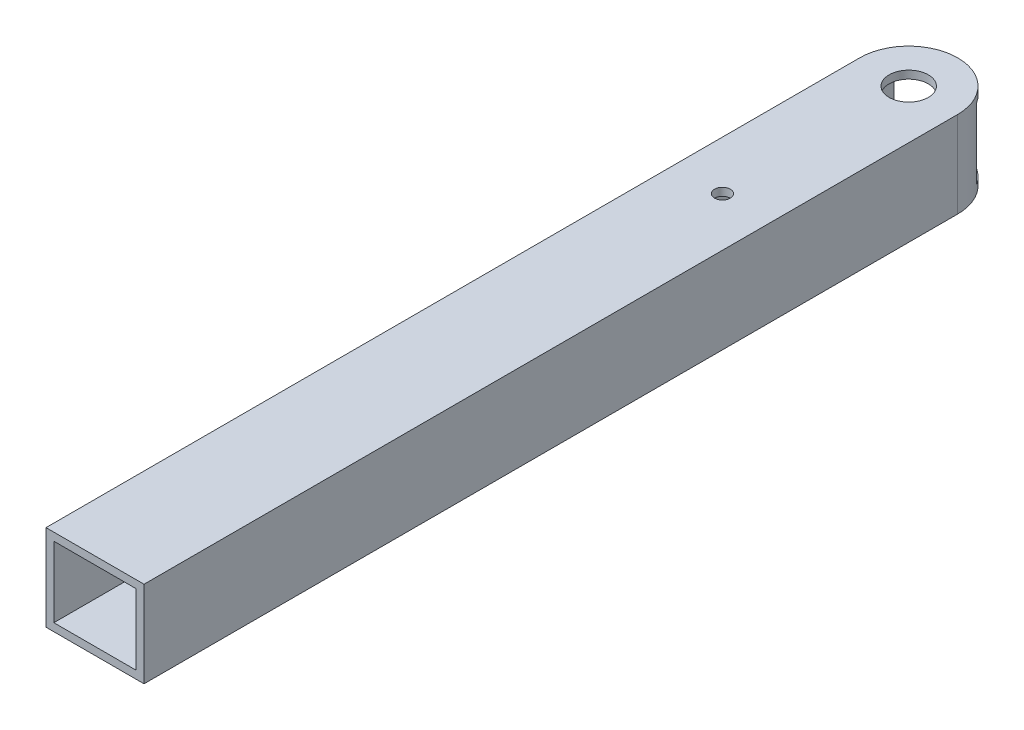
ISO-10303-21;
HEADER;
FILE_DESCRIPTION(('STEP AP214'),'2;1');
FILE_NAME('part.step','',(''),(''),'','','');
FILE_SCHEMA(('AUTOMOTIVE_DESIGN { 1 0 10303 214 1 1 1 1 }'));
ENDSEC;
DATA;
#1=APPLICATION_CONTEXT('core data for automotive mechanical design processes');
#2=APPLICATION_PROTOCOL_DEFINITION('international standard','automotive_design',2000,#1);
#3=PRODUCT_CONTEXT('',#1,'mechanical');
#4=PRODUCT('Part','Part','',(#3));
#5=PRODUCT_RELATED_PRODUCT_CATEGORY('part','',(#4));
#6=PRODUCT_DEFINITION_FORMATION('','',#4);
#7=PRODUCT_DEFINITION_CONTEXT('part definition',#1,'design');
#8=PRODUCT_DEFINITION('design','',#6,#7);
#9=PRODUCT_DEFINITION_SHAPE('','',#8);
#10=(LENGTH_UNIT() NAMED_UNIT(*) SI_UNIT(.MILLI.,.METRE.));
#11=(NAMED_UNIT(*) PLANE_ANGLE_UNIT() SI_UNIT($,.RADIAN.));
#12=(NAMED_UNIT(*) SI_UNIT($,.STERADIAN.) SOLID_ANGLE_UNIT());
#13=UNCERTAINTY_MEASURE_WITH_UNIT(LENGTH_MEASURE(1.E-05),#10,'distance_accuracy_value','');
#14=(GEOMETRIC_REPRESENTATION_CONTEXT(3) GLOBAL_UNCERTAINTY_ASSIGNED_CONTEXT((#13)) GLOBAL_UNIT_ASSIGNED_CONTEXT((#10,
#11,#12)) REPRESENTATION_CONTEXT('',''));
#15=CARTESIAN_POINT('',(0.,0.,0.));
#16=DIRECTION('',(0.,0.,1.));
#17=DIRECTION('',(1.,0.,0.));
#18=AXIS2_PLACEMENT_3D('',#15,#16,#17);
#19=CARTESIAN_POINT('',(25.,1.5,220.));
#20=DIRECTION('',(0.,-1.,0.));
#21=DIRECTION('',(1.,0.,0.));
#22=AXIS2_PLACEMENT_3D('',#19,#20,#21);
#23=PLANE('',#22);
#24=CARTESIAN_POINT('',(12.5,1.5,60.));
#25=DIRECTION('',(0.,-1.,0.));
#26=DIRECTION('',(0.,0.,-1.));
#27=AXIS2_PLACEMENT_3D('',#24,#25,#26);
#28=CIRCLE('',#27,2.00000000000106);
#29=CARTESIAN_POINT('',(12.5,1.5,57.9999999999989));
#30=VERTEX_POINT('',#29);
#31=EDGE_CURVE('E240',#30,#30,#28,.T.);
#32=ORIENTED_EDGE('',*,*,#31,.T.);
#33=EDGE_LOOP('',(#32));
#34=FACE_BOUND('',#33,.T.);
#35=CARTESIAN_POINT('',(12.5,1.5,12.5));
#36=DIRECTION('',(0.,-1.,0.));
#37=DIRECTION('',(0.,0.,-1.));
#38=AXIS2_PLACEMENT_3D('',#35,#36,#37);
#39=CIRCLE('',#38,5.);
#40=CARTESIAN_POINT('',(12.5,1.5,7.5));
#41=VERTEX_POINT('',#40);
#42=EDGE_CURVE('E171',#41,#41,#39,.T.);
#43=ORIENTED_EDGE('',*,*,#42,.T.);
#44=EDGE_LOOP('',(#43));
#45=FACE_BOUND('',#44,.T.);
#46=DIRECTION('',(0.,0.,-1.));
#47=VECTOR('',#46,1.);
#48=CARTESIAN_POINT('',(25.,1.5,220.));
#49=LINE('',#48,#47);
#50=CARTESIAN_POINT('',(25.,1.5,220.));
#51=VERTEX_POINT('',#50);
#52=CARTESIAN_POINT('',(25.,1.5,12.5));
#53=VERTEX_POINT('',#52);
#54=EDGE_CURVE('E149',#51,#53,#49,.T.);
#55=ORIENTED_EDGE('',*,*,#54,.T.);
#56=CARTESIAN_POINT('',(12.5,1.5,12.5));
#57=DIRECTION('',(0.,-1.,0.));
#58=DIRECTION('',(0.,0.,-1.));
#59=AXIS2_PLACEMENT_3D('',#56,#57,#58);
#60=CIRCLE('',#59,12.5);
#61=CARTESIAN_POINT('',(0.,1.5,12.5));
#62=VERTEX_POINT('',#61);
#63=EDGE_CURVE('E132',#62,#53,#60,.T.);
#64=ORIENTED_EDGE('',*,*,#63,.F.);
#65=DIRECTION('',(0.,0.,-1.));
#66=VECTOR('',#65,1.);
#67=CARTESIAN_POINT('',(0.,1.5,220.));
#68=LINE('',#67,#66);
#69=CARTESIAN_POINT('',(0.,1.5,220.));
#70=VERTEX_POINT('',#69);
#71=EDGE_CURVE('E167',#70,#62,#68,.T.);
#72=ORIENTED_EDGE('',*,*,#71,.F.);
#73=DIRECTION('',(-1.,0.,0.));
#74=VECTOR('',#73,1.);
#75=CARTESIAN_POINT('',(25.,1.5,220.));
#76=LINE('',#75,#74);
#77=EDGE_CURVE('E156',#51,#70,#76,.T.);
#78=ORIENTED_EDGE('',*,*,#77,.F.);
#79=EDGE_LOOP('',(#55,#64,#72,#78));
#80=FACE_BOUND('',#79,.T.);
#81=ADVANCED_FACE('F66',(#34,#45,#80),#23,.F.);
#82=CARTESIAN_POINT('',(0.,-20.5,220.));
#83=DIRECTION('',(0.,1.,0.));
#84=DIRECTION('',(0.,0.,1.));
#85=AXIS2_PLACEMENT_3D('',#82,#83,#84);
#86=PLANE('',#85);
#87=CARTESIAN_POINT('',(12.5,-20.5,60.));
#88=DIRECTION('',(0.,-1.,0.));
#89=DIRECTION('',(0.,0.,-1.));
#90=AXIS2_PLACEMENT_3D('',#87,#88,#89);
#91=CIRCLE('',#90,2.00000000000106);
#92=CARTESIAN_POINT('',(12.5,-20.5,57.9999999999989));
#93=VERTEX_POINT('',#92);
#94=EDGE_CURVE('E242',#93,#93,#91,.T.);
#95=ORIENTED_EDGE('',*,*,#94,.F.);
#96=EDGE_LOOP('',(#95));
#97=FACE_BOUND('',#96,.T.);
#98=CARTESIAN_POINT('',(12.5,-20.5,12.5));
#99=DIRECTION('',(0.,-1.,0.));
#100=DIRECTION('',(0.,0.,-1.));
#101=AXIS2_PLACEMENT_3D('',#98,#99,#100);
#102=CIRCLE('',#101,5.);
#103=CARTESIAN_POINT('',(12.5,-20.5,7.5));
#104=VERTEX_POINT('',#103);
#105=EDGE_CURVE('E177',#104,#104,#102,.T.);
#106=ORIENTED_EDGE('',*,*,#105,.F.);
#107=EDGE_LOOP('',(#106));
#108=FACE_BOUND('',#107,.T.);
#109=CARTESIAN_POINT('',(12.5,-20.5,12.5));
#110=DIRECTION('',(0.,-1.,0.));
#111=DIRECTION('',(0.,0.,-1.));
#112=AXIS2_PLACEMENT_3D('',#109,#110,#111);
#113=CIRCLE('',#112,12.5);
#114=CARTESIAN_POINT('',(0.,-20.5,12.5));
#115=VERTEX_POINT('',#114);
#116=CARTESIAN_POINT('',(25.,-20.5,12.5));
#117=VERTEX_POINT('',#116);
#118=EDGE_CURVE('E143',#115,#117,#113,.T.);
#119=ORIENTED_EDGE('',*,*,#118,.T.);
#120=DIRECTION('',(0.,0.,-1.));
#121=VECTOR('',#120,1.);
#122=CARTESIAN_POINT('',(25.,-20.5,220.));
#123=LINE('',#122,#121);
#124=CARTESIAN_POINT('',(25.,-20.5,220.));
#125=VERTEX_POINT('',#124);
#126=EDGE_CURVE('E152',#125,#117,#123,.T.);
#127=ORIENTED_EDGE('',*,*,#126,.F.);
#128=DIRECTION('',(1.,0.,0.));
#129=VECTOR('',#128,1.);
#130=CARTESIAN_POINT('',(0.,-20.5,220.));
#131=LINE('',#130,#129);
#132=CARTESIAN_POINT('',(0.,-20.5,220.));
#133=VERTEX_POINT('',#132);
#134=EDGE_CURVE('E161',#133,#125,#131,.T.);
#135=ORIENTED_EDGE('',*,*,#134,.F.);
#136=DIRECTION('',(0.,0.,-1.));
#137=VECTOR('',#136,1.);
#138=CARTESIAN_POINT('',(0.,-20.5,220.));
#139=LINE('',#138,#137);
#140=EDGE_CURVE('E159',#133,#115,#139,.T.);
#141=ORIENTED_EDGE('',*,*,#140,.T.);
#142=EDGE_LOOP('',(#119,#127,#135,#141));
#143=FACE_BOUND('',#142,.T.);
#144=ADVANCED_FACE('F218',(#97,#108,#143),#86,.F.);
#145=CARTESIAN_POINT('',(25.,-0.499999999999997,220.));
#146=DIRECTION('',(0.,-1.,0.));
#147=DIRECTION('',(1.,0.,0.));
#148=AXIS2_PLACEMENT_3D('',#145,#146,#147);
#149=PLANE('',#148);
#150=CARTESIAN_POINT('',(12.5,-0.499999999999999,60.));
#151=DIRECTION('',(0.,-1.,0.));
#152=DIRECTION('',(1.,0.,0.));
#153=AXIS2_PLACEMENT_3D('',#150,#151,#152);
#154=CIRCLE('',#153,2.00000000000106);
#155=CARTESIAN_POINT('',(14.5000000000011,-0.499999999999999,60.));
#156=VERTEX_POINT('',#155);
#157=EDGE_CURVE('E182',#156,#156,#154,.T.);
#158=ORIENTED_EDGE('',*,*,#157,.F.);
#159=EDGE_LOOP('',(#158));
#160=FACE_BOUND('',#159,.T.);
#161=CARTESIAN_POINT('',(12.5,-0.499999999999999,12.5));
#162=DIRECTION('',(0.,-1.,0.));
#163=DIRECTION('',(1.,0.,0.));
#164=AXIS2_PLACEMENT_3D('',#161,#162,#163);
#165=CIRCLE('',#164,5.);
#166=CARTESIAN_POINT('',(17.5,-0.499999999999998,12.5));
#167=VERTEX_POINT('',#166);
#168=EDGE_CURVE('E153',#167,#167,#165,.T.);
#169=ORIENTED_EDGE('',*,*,#168,.F.);
#170=EDGE_LOOP('',(#169));
#171=FACE_BOUND('',#170,.T.);
#172=CARTESIAN_POINT('',(12.5,-0.499999999999999,12.5));
#173=DIRECTION('',(0.,-1.,0.));
#174=DIRECTION('',(1.,0.,0.));
#175=AXIS2_PLACEMENT_3D('',#172,#173,#174);
#176=CIRCLE('',#175,12.5);
#177=CARTESIAN_POINT('',(2.,-0.5,5.71767001687474));
#178=VERTEX_POINT('',#177);
#179=CARTESIAN_POINT('',(23.,-0.499999999999997,5.71767001687473));
#180=VERTEX_POINT('',#179);
#181=EDGE_CURVE('E190',#178,#180,#176,.T.);
#182=ORIENTED_EDGE('',*,*,#181,.T.);
#183=DIRECTION('',(0.,0.,-1.));
#184=VECTOR('',#183,1.);
#185=CARTESIAN_POINT('',(23.,-0.499999999999997,220.));
#186=LINE('',#185,#184);
#187=CARTESIAN_POINT('',(23.,-0.499999999999997,220.));
#188=VERTEX_POINT('',#187);
#189=EDGE_CURVE('E200',#188,#180,#186,.T.);
#190=ORIENTED_EDGE('',*,*,#189,.F.);
#191=DIRECTION('',(-1.,0.,0.));
#192=VECTOR('',#191,1.);
#193=CARTESIAN_POINT('',(25.,-0.499999999999997,220.));
#194=LINE('',#193,#192);
#195=CARTESIAN_POINT('',(2.,-0.5,220.));
#196=VERTEX_POINT('',#195);
#197=EDGE_CURVE('E192',#188,#196,#194,.T.);
#198=ORIENTED_EDGE('',*,*,#197,.T.);
#199=DIRECTION('',(0.,0.,-1.));
#200=VECTOR('',#199,1.);
#201=CARTESIAN_POINT('',(2.,-0.5,220.));
#202=LINE('',#201,#200);
#203=EDGE_CURVE('E207',#196,#178,#202,.T.);
#204=ORIENTED_EDGE('',*,*,#203,.T.);
#205=EDGE_LOOP('',(#182,#190,#198,#204));
#206=FACE_BOUND('',#205,.T.);
#207=ADVANCED_FACE('F236',(#160,#171,#206),#149,.T.);
#208=CARTESIAN_POINT('',(0.,-18.5,220.));
#209=DIRECTION('',(0.,1.,0.));
#210=DIRECTION('',(0.,0.,1.));
#211=AXIS2_PLACEMENT_3D('',#208,#209,#210);
#212=PLANE('',#211);
#213=CARTESIAN_POINT('',(12.5,-18.5,60.));
#214=DIRECTION('',(0.,1.,0.));
#215=DIRECTION('',(0.,0.,1.));
#216=AXIS2_PLACEMENT_3D('',#213,#214,#215);
#217=CIRCLE('',#216,2.00000000000106);
#218=CARTESIAN_POINT('',(12.5,-18.5,62.0000000000011));
#219=VERTEX_POINT('',#218);
#220=EDGE_CURVE('E69',#219,#219,#217,.T.);
#221=ORIENTED_EDGE('',*,*,#220,.F.);
#222=EDGE_LOOP('',(#221));
#223=FACE_BOUND('',#222,.T.);
#224=CARTESIAN_POINT('',(12.5,-18.5,12.5));
#225=DIRECTION('',(0.,1.,0.));
#226=DIRECTION('',(0.,0.,1.));
#227=AXIS2_PLACEMENT_3D('',#224,#225,#226);
#228=CIRCLE('',#227,5.);
#229=CARTESIAN_POINT('',(12.5,-18.5,17.5));
#230=VERTEX_POINT('',#229);
#231=EDGE_CURVE('E169',#230,#230,#228,.T.);
#232=ORIENTED_EDGE('',*,*,#231,.F.);
#233=EDGE_LOOP('',(#232));
#234=FACE_BOUND('',#233,.T.);
#235=DIRECTION('',(0.,0.,-1.));
#236=VECTOR('',#235,1.);
#237=CARTESIAN_POINT('',(23.,-18.5,220.));
#238=LINE('',#237,#236);
#239=CARTESIAN_POINT('',(23.,-18.5,220.));
#240=VERTEX_POINT('',#239);
#241=CARTESIAN_POINT('',(23.,-18.5,5.71767001687473));
#242=VERTEX_POINT('',#241);
#243=EDGE_CURVE('E89',#240,#242,#238,.T.);
#244=ORIENTED_EDGE('',*,*,#243,.T.);
#245=CARTESIAN_POINT('',(12.5,-18.5,12.5));
#246=DIRECTION('',(0.,1.,0.));
#247=DIRECTION('',(0.,0.,1.));
#248=AXIS2_PLACEMENT_3D('',#245,#246,#247);
#249=CIRCLE('',#248,12.5);
#250=CARTESIAN_POINT('',(2.,-18.5,5.71767001687473));
#251=VERTEX_POINT('',#250);
#252=EDGE_CURVE('E74',#242,#251,#249,.T.);
#253=ORIENTED_EDGE('',*,*,#252,.T.);
#254=DIRECTION('',(0.,0.,-1.));
#255=VECTOR('',#254,1.);
#256=CARTESIAN_POINT('',(2.,-18.5,220.));
#257=LINE('',#256,#255);
#258=CARTESIAN_POINT('',(2.,-18.5,220.));
#259=VERTEX_POINT('',#258);
#260=EDGE_CURVE('E204',#259,#251,#257,.T.);
#261=ORIENTED_EDGE('',*,*,#260,.F.);
#262=DIRECTION('',(1.,0.,0.));
#263=VECTOR('',#262,1.);
#264=CARTESIAN_POINT('',(0.,-18.5,220.));
#265=LINE('',#264,#263);
#266=EDGE_CURVE('E196',#259,#240,#265,.T.);
#267=ORIENTED_EDGE('',*,*,#266,.T.);
#268=EDGE_LOOP('',(#244,#253,#261,#267));
#269=FACE_BOUND('',#268,.T.);
#270=ADVANCED_FACE('F264',(#223,#234,#269),#212,.T.);
#271=CARTESIAN_POINT('',(25.,-20.5,220.));
#272=DIRECTION('',(-1.,0.,0.));
#273=DIRECTION('',(0.,0.,1.));
#274=AXIS2_PLACEMENT_3D('',#271,#272,#273);
#275=PLANE('',#274);
#276=DIRECTION('',(0.,-1.,0.));
#277=VECTOR('',#276,1.);
#278=CARTESIAN_POINT('',(25.,1.5,12.5));
#279=LINE('',#278,#277);
#280=EDGE_CURVE('E135',#53,#117,#279,.T.);
#281=ORIENTED_EDGE('',*,*,#280,.F.);
#282=ORIENTED_EDGE('',*,*,#54,.F.);
#283=DIRECTION('',(0.,1.,0.));
#284=VECTOR('',#283,1.);
#285=CARTESIAN_POINT('',(25.,-20.5,220.));
#286=LINE('',#285,#284);
#287=EDGE_CURVE('E157',#125,#51,#286,.T.);
#288=ORIENTED_EDGE('',*,*,#287,.F.);
#289=ORIENTED_EDGE('',*,*,#126,.T.);
#290=EDGE_LOOP('',(#281,#282,#288,#289));
#291=FACE_BOUND('',#290,.T.);
#292=ADVANCED_FACE('F147',(#291),#275,.F.);
#293=CARTESIAN_POINT('',(23.,-20.5,220.));
#294=DIRECTION('',(-1.,0.,0.));
#295=DIRECTION('',(0.,0.,1.));
#296=AXIS2_PLACEMENT_3D('',#293,#294,#295);
#297=PLANE('',#296);
#298=ORIENTED_EDGE('',*,*,#189,.T.);
#299=DIRECTION('',(0.,-1.,0.));
#300=VECTOR('',#299,1.);
#301=CARTESIAN_POINT('',(23.,1.5,5.71767001687473));
#302=LINE('',#301,#300);
#303=EDGE_CURVE('E12',#180,#242,#302,.T.);
#304=ORIENTED_EDGE('',*,*,#303,.T.);
#305=ORIENTED_EDGE('',*,*,#243,.F.);
#306=DIRECTION('',(0.,1.,0.));
#307=VECTOR('',#306,1.);
#308=CARTESIAN_POINT('',(23.,-20.5,220.));
#309=LINE('',#308,#307);
#310=EDGE_CURVE('E198',#240,#188,#309,.T.);
#311=ORIENTED_EDGE('',*,*,#310,.T.);
#312=EDGE_LOOP('',(#298,#304,#305,#311));
#313=FACE_BOUND('',#312,.T.);
#314=ADVANCED_FACE('F261',(#313),#297,.T.);
#315=CARTESIAN_POINT('',(2.,1.5,220.));
#316=DIRECTION('',(1.,0.,0.));
#317=DIRECTION('',(0.,1.,0.));
#318=AXIS2_PLACEMENT_3D('',#315,#316,#317);
#319=PLANE('',#318);
#320=ORIENTED_EDGE('',*,*,#260,.T.);
#321=DIRECTION('',(0.,-1.,0.));
#322=VECTOR('',#321,1.);
#323=CARTESIAN_POINT('',(2.,1.5,5.71767001687474));
#324=LINE('',#323,#322);
#325=EDGE_CURVE('E82',#251,#178,#324,.F.);
#326=ORIENTED_EDGE('',*,*,#325,.T.);
#327=ORIENTED_EDGE('',*,*,#203,.F.);
#328=DIRECTION('',(0.,-1.,0.));
#329=VECTOR('',#328,1.);
#330=CARTESIAN_POINT('',(2.,1.5,220.));
#331=LINE('',#330,#329);
#332=EDGE_CURVE('E194',#196,#259,#331,.T.);
#333=ORIENTED_EDGE('',*,*,#332,.T.);
#334=EDGE_LOOP('',(#320,#326,#327,#333));
#335=FACE_BOUND('',#334,.T.);
#336=ADVANCED_FACE('F228',(#335),#319,.T.);
#337=CARTESIAN_POINT('',(0.,0.,220.));
#338=DIRECTION('',(0.,0.,1.));
#339=DIRECTION('',(1.,0.,0.));
#340=AXIS2_PLACEMENT_3D('',#337,#338,#339);
#341=PLANE('',#340);
#342=ORIENTED_EDGE('',*,*,#77,.T.);
#343=DIRECTION('',(0.,-1.,0.));
#344=VECTOR('',#343,1.);
#345=CARTESIAN_POINT('',(0.,1.5,220.));
#346=LINE('',#345,#344);
#347=EDGE_CURVE('E211',#70,#133,#346,.T.);
#348=ORIENTED_EDGE('',*,*,#347,.T.);
#349=ORIENTED_EDGE('',*,*,#134,.T.);
#350=ORIENTED_EDGE('',*,*,#287,.T.);
#351=EDGE_LOOP('',(#342,#348,#349,#350));
#352=FACE_BOUND('',#351,.T.);
#353=ORIENTED_EDGE('',*,*,#332,.F.);
#354=ORIENTED_EDGE('',*,*,#197,.F.);
#355=ORIENTED_EDGE('',*,*,#310,.F.);
#356=ORIENTED_EDGE('',*,*,#266,.F.);
#357=EDGE_LOOP('',(#353,#354,#355,#356));
#358=FACE_BOUND('',#357,.T.);
#359=ADVANCED_FACE('F214',(#352,#358),#341,.T.);
#360=CARTESIAN_POINT('',(0.,1.5,220.));
#361=DIRECTION('',(1.,0.,0.));
#362=DIRECTION('',(0.,1.,0.));
#363=AXIS2_PLACEMENT_3D('',#360,#361,#362);
#364=PLANE('',#363);
#365=ORIENTED_EDGE('',*,*,#71,.T.);
#366=DIRECTION('',(0.,-1.,0.));
#367=VECTOR('',#366,1.);
#368=CARTESIAN_POINT('',(0.,1.5,12.5));
#369=LINE('',#368,#367);
#370=EDGE_CURVE('E138',#62,#115,#369,.T.);
#371=ORIENTED_EDGE('',*,*,#370,.T.);
#372=ORIENTED_EDGE('',*,*,#140,.F.);
#373=ORIENTED_EDGE('',*,*,#347,.F.);
#374=EDGE_LOOP('',(#365,#371,#372,#373));
#375=FACE_BOUND('',#374,.T.);
#376=ADVANCED_FACE('F220',(#375),#364,.F.);
#377=CARTESIAN_POINT('',(12.5,1.5,12.5));
#378=DIRECTION('',(0.,-1.,0.));
#379=DIRECTION('',(0.,0.,-1.));
#380=AXIS2_PLACEMENT_3D('',#377,#378,#379);
#381=CYLINDRICAL_SURFACE('',#380,12.5);
#382=ORIENTED_EDGE('',*,*,#280,.T.);
#383=ORIENTED_EDGE('',*,*,#118,.F.);
#384=ORIENTED_EDGE('',*,*,#370,.F.);
#385=ORIENTED_EDGE('',*,*,#63,.T.);
#386=EDGE_LOOP('',(#382,#383,#384,#385));
#387=FACE_BOUND('',#386,.T.);
#388=ORIENTED_EDGE('',*,*,#325,.F.);
#389=ORIENTED_EDGE('',*,*,#252,.F.);
#390=ORIENTED_EDGE('',*,*,#303,.F.);
#391=ORIENTED_EDGE('',*,*,#181,.F.);
#392=EDGE_LOOP('',(#388,#389,#390,#391));
#393=FACE_BOUND('',#392,.T.);
#394=ADVANCED_FACE('F134',(#387,#393),#381,.T.);
#395=CARTESIAN_POINT('',(12.5,1.5,12.5));
#396=DIRECTION('',(0.,-1.,0.));
#397=DIRECTION('',(0.,0.,-1.));
#398=AXIS2_PLACEMENT_3D('',#395,#396,#397);
#399=CYLINDRICAL_SURFACE('',#398,5.);
#400=ORIENTED_EDGE('',*,*,#231,.T.);
#401=EDGE_LOOP('',(#400));
#402=FACE_BOUND('',#401,.T.);
#403=ORIENTED_EDGE('',*,*,#105,.T.);
#404=EDGE_LOOP('',(#403));
#405=FACE_BOUND('',#404,.T.);
#406=ADVANCED_FACE('F226',(#402,#405),#399,.F.);
#407=ORIENTED_EDGE('',*,*,#168,.T.);
#408=EDGE_LOOP('',(#407));
#409=FACE_BOUND('',#408,.T.);
#410=ORIENTED_EDGE('',*,*,#42,.F.);
#411=EDGE_LOOP('',(#410));
#412=FACE_BOUND('',#411,.T.);
#413=ADVANCED_FACE('F253',(#409,#412),#399,.F.);
#414=CARTESIAN_POINT('',(12.5,1.5,60.));
#415=DIRECTION('',(0.,-1.,0.));
#416=DIRECTION('',(0.,0.,-1.));
#417=AXIS2_PLACEMENT_3D('',#414,#415,#416);
#418=CYLINDRICAL_SURFACE('',#417,2.00000000000106);
#419=ORIENTED_EDGE('',*,*,#220,.T.);
#420=EDGE_LOOP('',(#419));
#421=FACE_BOUND('',#420,.T.);
#422=ORIENTED_EDGE('',*,*,#94,.T.);
#423=EDGE_LOOP('',(#422));
#424=FACE_BOUND('',#423,.T.);
#425=ADVANCED_FACE('F248',(#421,#424),#418,.F.);
#426=ORIENTED_EDGE('',*,*,#157,.T.);
#427=EDGE_LOOP('',(#426));
#428=FACE_BOUND('',#427,.T.);
#429=ORIENTED_EDGE('',*,*,#31,.F.);
#430=EDGE_LOOP('',(#429));
#431=FACE_BOUND('',#430,.T.);
#432=ADVANCED_FACE('F352',(#428,#431),#418,.F.);
#433=CLOSED_SHELL('',(#81,#144,#207,#270,#292,#314,#336,#359,#376,#394,#406,#413,#425,#432));
#434=MANIFOLD_SOLID_BREP('B2',#433);
#435=ADVANCED_BREP_SHAPE_REPRESENTATION('',(#18,#434),#14);
#436=SHAPE_DEFINITION_REPRESENTATION(#9,#435);
ENDSEC;
END-ISO-10303-21;
